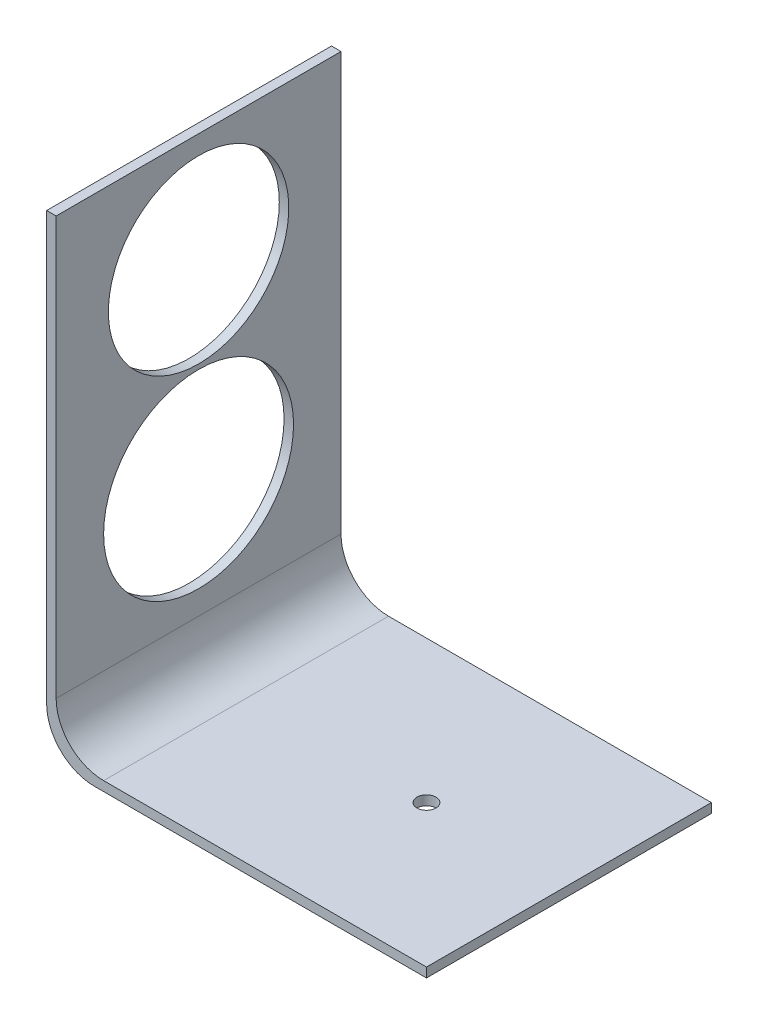
ISO-10303-21;
HEADER;
FILE_DESCRIPTION(('STEP AP214'),'2;1');
FILE_NAME('part.step','',(''),(''),'','','');
FILE_SCHEMA(('AUTOMOTIVE_DESIGN { 1 0 10303 214 1 1 1 1 }'));
ENDSEC;
DATA;
#1=APPLICATION_CONTEXT('core data for automotive mechanical design processes');
#2=APPLICATION_PROTOCOL_DEFINITION('international standard','automotive_design',2000,#1);
#3=PRODUCT_CONTEXT('',#1,'mechanical');
#4=PRODUCT('Part','Part','',(#3));
#5=PRODUCT_RELATED_PRODUCT_CATEGORY('part','',(#4));
#6=PRODUCT_DEFINITION_FORMATION('','',#4);
#7=PRODUCT_DEFINITION_CONTEXT('part definition',#1,'design');
#8=PRODUCT_DEFINITION('design','',#6,#7);
#9=PRODUCT_DEFINITION_SHAPE('','',#8);
#10=(LENGTH_UNIT() NAMED_UNIT(*) SI_UNIT(.MILLI.,.METRE.));
#11=(NAMED_UNIT(*) PLANE_ANGLE_UNIT() SI_UNIT($,.RADIAN.));
#12=(NAMED_UNIT(*) SI_UNIT($,.STERADIAN.) SOLID_ANGLE_UNIT());
#13=UNCERTAINTY_MEASURE_WITH_UNIT(LENGTH_MEASURE(1.E-05),#10,'distance_accuracy_value','');
#14=(GEOMETRIC_REPRESENTATION_CONTEXT(3) GLOBAL_UNCERTAINTY_ASSIGNED_CONTEXT((#13)) GLOBAL_UNIT_ASSIGNED_CONTEXT((#10,
#11,#12)) REPRESENTATION_CONTEXT('',''));
#15=CARTESIAN_POINT('',(0.,0.,0.));
#16=DIRECTION('',(0.,0.,1.));
#17=DIRECTION('',(1.,0.,0.));
#18=AXIS2_PLACEMENT_3D('',#15,#16,#17);
#19=CARTESIAN_POINT('',(-24.8275862068966,-14.7413793103448,60.));
#20=DIRECTION('',(1.,0.,0.));
#21=DIRECTION('',(0.,0.,-1.));
#22=AXIS2_PLACEMENT_3D('',#19,#20,#21);
#23=PLANE('',#22);
#24=CARTESIAN_POINT('',(-24.8275862068966,52.2586206896552,30.));
#25=DIRECTION('',(1.,0.,0.));
#26=DIRECTION('',(0.,0.,-1.));
#27=AXIS2_PLACEMENT_3D('',#24,#25,#26);
#28=CIRCLE('',#27,19.);
#29=CARTESIAN_POINT('',(-24.8275862068966,52.2586206896552,11.));
#30=VERTEX_POINT('',#29);
#31=EDGE_CURVE('E182',#30,#30,#28,.T.);
#32=ORIENTED_EDGE('',*,*,#31,.T.);
#33=EDGE_LOOP('',(#32));
#34=FACE_BOUND('',#33,.T.);
#35=CARTESIAN_POINT('',(-24.8275862068966,12.2586206896553,30.));
#36=DIRECTION('',(1.,0.,0.));
#37=DIRECTION('',(0.,0.,-1.));
#38=AXIS2_PLACEMENT_3D('',#35,#36,#37);
#39=CIRCLE('',#38,20.);
#40=CARTESIAN_POINT('',(-24.8275862068966,12.2586206896553,9.99999999999999));
#41=VERTEX_POINT('',#40);
#42=EDGE_CURVE('E133',#41,#41,#39,.T.);
#43=ORIENTED_EDGE('',*,*,#42,.T.);
#44=EDGE_LOOP('',(#43));
#45=FACE_BOUND('',#44,.T.);
#46=DIRECTION('',(0.,-1.,0.));
#47=VECTOR('',#46,1.);
#48=CARTESIAN_POINT('',(-24.8275862068966,-14.7413793103448,0.));
#49=LINE('',#48,#47);
#50=CARTESIAN_POINT('',(-24.8275862068966,75.2586206896552,0.));
#51=VERTEX_POINT('',#50);
#52=CARTESIAN_POINT('',(-24.8275862068966,-14.7413793103448,0.));
#53=VERTEX_POINT('',#52);
#54=EDGE_CURVE('E129',#51,#53,#49,.T.);
#55=ORIENTED_EDGE('',*,*,#54,.T.);
#56=DIRECTION('',(0.,0.,-1.));
#57=VECTOR('',#56,1.);
#58=CARTESIAN_POINT('',(-24.8275862068966,-14.7413793103448,60.));
#59=LINE('',#58,#57);
#60=CARTESIAN_POINT('',(-24.8275862068966,-14.7413793103448,60.));
#61=VERTEX_POINT('',#60);
#62=EDGE_CURVE('E11',#61,#53,#59,.T.);
#63=ORIENTED_EDGE('',*,*,#62,.F.);
#64=DIRECTION('',(0.,-1.,0.));
#65=VECTOR('',#64,1.);
#66=CARTESIAN_POINT('',(-24.8275862068966,-14.7413793103448,60.));
#67=LINE('',#66,#65);
#68=CARTESIAN_POINT('',(-24.8275862068966,75.2586206896552,60.));
#69=VERTEX_POINT('',#68);
#70=EDGE_CURVE('E144',#69,#61,#67,.T.);
#71=ORIENTED_EDGE('',*,*,#70,.F.);
#72=DIRECTION('',(0.,0.,-1.));
#73=VECTOR('',#72,1.);
#74=CARTESIAN_POINT('',(-24.8275862068966,75.2586206896552,60.));
#75=LINE('',#74,#73);
#76=EDGE_CURVE('E125',#69,#51,#75,.T.);
#77=ORIENTED_EDGE('',*,*,#76,.T.);
#78=EDGE_LOOP('',(#55,#63,#71,#77));
#79=FACE_BOUND('',#78,.T.);
#80=ADVANCED_FACE('F33',(#34,#45,#79),#23,.F.);
#81=CARTESIAN_POINT('',(-14.8275862068966,-14.7413793103448,60.));
#82=DIRECTION('',(0.,0.,-1.));
#83=DIRECTION('',(-1.,0.,0.));
#84=AXIS2_PLACEMENT_3D('',#81,#82,#83);
#85=CYLINDRICAL_SURFACE('',#84,10.);
#86=CARTESIAN_POINT('',(-14.8275862068966,-14.7413793103448,0.));
#87=DIRECTION('',(0.,0.,1.));
#88=DIRECTION('',(-1.,0.,0.));
#89=AXIS2_PLACEMENT_3D('',#86,#87,#88);
#90=CIRCLE('',#89,10.);
#91=CARTESIAN_POINT('',(-14.8275862068965,-24.7413793103448,0.));
#92=VERTEX_POINT('',#91);
#93=EDGE_CURVE('E132',#53,#92,#90,.T.);
#94=ORIENTED_EDGE('',*,*,#93,.T.);
#95=DIRECTION('',(0.,0.,-1.));
#96=VECTOR('',#95,1.);
#97=CARTESIAN_POINT('',(-14.8275862068965,-24.7413793103448,60.));
#98=LINE('',#97,#96);
#99=CARTESIAN_POINT('',(-14.8275862068965,-24.7413793103448,60.));
#100=VERTEX_POINT('',#99);
#101=EDGE_CURVE('E41',#100,#92,#98,.T.);
#102=ORIENTED_EDGE('',*,*,#101,.F.);
#103=CARTESIAN_POINT('',(-14.8275862068966,-14.7413793103448,60.));
#104=DIRECTION('',(0.,0.,1.));
#105=DIRECTION('',(-1.,0.,0.));
#106=AXIS2_PLACEMENT_3D('',#103,#104,#105);
#107=CIRCLE('',#106,10.);
#108=EDGE_CURVE('E92',#61,#100,#107,.T.);
#109=ORIENTED_EDGE('',*,*,#108,.F.);
#110=ORIENTED_EDGE('',*,*,#62,.T.);
#111=EDGE_LOOP('',(#94,#102,#109,#110));
#112=FACE_BOUND('',#111,.T.);
#113=ADVANCED_FACE('F207',(#112),#85,.T.);
#114=CARTESIAN_POINT('',(55.1724137931034,-24.7413793103448,60.));
#115=DIRECTION('',(0.,1.,0.));
#116=DIRECTION('',(-1.,0.,0.));
#117=AXIS2_PLACEMENT_3D('',#114,#115,#116);
#118=PLANE('',#117);
#119=CARTESIAN_POINT('',(25.1724137931034,-24.7413793103448,30.));
#120=DIRECTION('',(0.,1.,0.));
#121=DIRECTION('',(-1.,0.,0.));
#122=AXIS2_PLACEMENT_3D('',#119,#120,#121);
#123=CIRCLE('',#122,2.);
#124=CARTESIAN_POINT('',(23.1724137931034,-24.7413793103448,30.));
#125=VERTEX_POINT('',#124);
#126=EDGE_CURVE('E188',#125,#125,#123,.T.);
#127=ORIENTED_EDGE('',*,*,#126,.T.);
#128=EDGE_LOOP('',(#127));
#129=FACE_BOUND('',#128,.T.);
#130=DIRECTION('',(1.,0.,0.));
#131=VECTOR('',#130,1.);
#132=CARTESIAN_POINT('',(55.1724137931034,-24.7413793103448,0.));
#133=LINE('',#132,#131);
#134=CARTESIAN_POINT('',(55.1724137931034,-24.7413793103448,0.));
#135=VERTEX_POINT('',#134);
#136=EDGE_CURVE('E135',#92,#135,#133,.T.);
#137=ORIENTED_EDGE('',*,*,#136,.T.);
#138=DIRECTION('',(0.,0.,-1.));
#139=VECTOR('',#138,1.);
#140=CARTESIAN_POINT('',(55.1724137931034,-24.7413793103448,60.));
#141=LINE('',#140,#139);
#142=CARTESIAN_POINT('',(55.1724137931034,-24.7413793103448,60.));
#143=VERTEX_POINT('',#142);
#144=EDGE_CURVE('E151',#143,#135,#141,.T.);
#145=ORIENTED_EDGE('',*,*,#144,.F.);
#146=DIRECTION('',(1.,0.,0.));
#147=VECTOR('',#146,1.);
#148=CARTESIAN_POINT('',(55.1724137931034,-24.7413793103448,60.));
#149=LINE('',#148,#147);
#150=EDGE_CURVE('E159',#100,#143,#149,.T.);
#151=ORIENTED_EDGE('',*,*,#150,.F.);
#152=ORIENTED_EDGE('',*,*,#101,.T.);
#153=EDGE_LOOP('',(#137,#145,#151,#152));
#154=FACE_BOUND('',#153,.T.);
#155=ADVANCED_FACE('F157',(#129,#154),#118,.F.);
#156=CARTESIAN_POINT('',(55.1724137931034,-22.7413793103448,60.));
#157=DIRECTION('',(-1.,0.,0.));
#158=DIRECTION('',(0.,0.,1.));
#159=AXIS2_PLACEMENT_3D('',#156,#157,#158);
#160=PLANE('',#159);
#161=DIRECTION('',(0.,1.,0.));
#162=VECTOR('',#161,1.);
#163=CARTESIAN_POINT('',(55.1724137931034,-22.7413793103448,0.));
#164=LINE('',#163,#162);
#165=CARTESIAN_POINT('',(55.1724137931034,-22.7413793103448,0.));
#166=VERTEX_POINT('',#165);
#167=EDGE_CURVE('E137',#135,#166,#164,.T.);
#168=ORIENTED_EDGE('',*,*,#167,.T.);
#169=DIRECTION('',(0.,0.,-1.));
#170=VECTOR('',#169,1.);
#171=CARTESIAN_POINT('',(55.1724137931034,-22.7413793103448,60.));
#172=LINE('',#171,#170);
#173=CARTESIAN_POINT('',(55.1724137931034,-22.7413793103448,60.));
#174=VERTEX_POINT('',#173);
#175=EDGE_CURVE('E148',#174,#166,#172,.T.);
#176=ORIENTED_EDGE('',*,*,#175,.F.);
#177=DIRECTION('',(0.,1.,0.));
#178=VECTOR('',#177,1.);
#179=CARTESIAN_POINT('',(55.1724137931034,-22.7413793103448,60.));
#180=LINE('',#179,#178);
#181=EDGE_CURVE('E171',#143,#174,#180,.T.);
#182=ORIENTED_EDGE('',*,*,#181,.F.);
#183=ORIENTED_EDGE('',*,*,#144,.T.);
#184=EDGE_LOOP('',(#168,#176,#182,#183));
#185=FACE_BOUND('',#184,.T.);
#186=ADVANCED_FACE('F167',(#185),#160,.F.);
#187=CARTESIAN_POINT('',(-12.8275862068965,-22.7413793103448,60.));
#188=DIRECTION('',(0.,-1.,0.));
#189=DIRECTION('',(0.,0.,-1.));
#190=AXIS2_PLACEMENT_3D('',#187,#188,#189);
#191=PLANE('',#190);
#192=CARTESIAN_POINT('',(25.1724137931034,-22.7413793103448,30.));
#193=DIRECTION('',(0.,1.,0.));
#194=DIRECTION('',(0.,0.,1.));
#195=AXIS2_PLACEMENT_3D('',#192,#193,#194);
#196=CIRCLE('',#195,2.);
#197=CARTESIAN_POINT('',(25.1724137931034,-22.7413793103448,32.));
#198=VERTEX_POINT('',#197);
#199=EDGE_CURVE('E191',#198,#198,#196,.T.);
#200=ORIENTED_EDGE('',*,*,#199,.F.);
#201=EDGE_LOOP('',(#200));
#202=FACE_BOUND('',#201,.T.);
#203=DIRECTION('',(-1.,0.,0.));
#204=VECTOR('',#203,1.);
#205=CARTESIAN_POINT('',(-12.8275862068965,-22.7413793103448,0.));
#206=LINE('',#205,#204);
#207=CARTESIAN_POINT('',(-12.8275862068965,-22.7413793103448,0.));
#208=VERTEX_POINT('',#207);
#209=EDGE_CURVE('E139',#166,#208,#206,.T.);
#210=ORIENTED_EDGE('',*,*,#209,.T.);
#211=DIRECTION('',(0.,0.,-1.));
#212=VECTOR('',#211,1.);
#213=CARTESIAN_POINT('',(-12.8275862068965,-22.7413793103448,60.));
#214=LINE('',#213,#212);
#215=CARTESIAN_POINT('',(-12.8275862068965,-22.7413793103448,60.));
#216=VERTEX_POINT('',#215);
#217=EDGE_CURVE('E120',#216,#208,#214,.T.);
#218=ORIENTED_EDGE('',*,*,#217,.F.);
#219=DIRECTION('',(-1.,0.,0.));
#220=VECTOR('',#219,1.);
#221=CARTESIAN_POINT('',(-12.8275862068965,-22.7413793103448,60.));
#222=LINE('',#221,#220);
#223=EDGE_CURVE('E111',#174,#216,#222,.T.);
#224=ORIENTED_EDGE('',*,*,#223,.F.);
#225=ORIENTED_EDGE('',*,*,#175,.T.);
#226=EDGE_LOOP('',(#210,#218,#224,#225));
#227=FACE_BOUND('',#226,.T.);
#228=ADVANCED_FACE('F170',(#202,#227),#191,.F.);
#229=CARTESIAN_POINT('',(-12.8275862068965,-12.7413793103448,60.));
#230=DIRECTION('',(0.,0.,-1.));
#231=DIRECTION('',(-1.,0.,0.));
#232=AXIS2_PLACEMENT_3D('',#229,#230,#231);
#233=CYLINDRICAL_SURFACE('',#232,10.);
#234=CARTESIAN_POINT('',(-12.8275862068965,-12.7413793103448,0.));
#235=DIRECTION('',(0.,0.,-1.));
#236=DIRECTION('',(-1.,0.,0.));
#237=AXIS2_PLACEMENT_3D('',#234,#235,#236);
#238=CIRCLE('',#237,10.);
#239=CARTESIAN_POINT('',(-22.8275862068965,-12.7413793103448,0.));
#240=VERTEX_POINT('',#239);
#241=EDGE_CURVE('E119',#208,#240,#238,.T.);
#242=ORIENTED_EDGE('',*,*,#241,.T.);
#243=DIRECTION('',(0.,0.,-1.));
#244=VECTOR('',#243,1.);
#245=CARTESIAN_POINT('',(-22.8275862068965,-12.7413793103448,60.));
#246=LINE('',#245,#244);
#247=CARTESIAN_POINT('',(-22.8275862068965,-12.7413793103448,60.));
#248=VERTEX_POINT('',#247);
#249=EDGE_CURVE('E116',#248,#240,#246,.T.);
#250=ORIENTED_EDGE('',*,*,#249,.F.);
#251=CARTESIAN_POINT('',(-12.8275862068965,-12.7413793103448,60.));
#252=DIRECTION('',(0.,0.,-1.));
#253=DIRECTION('',(-1.,0.,0.));
#254=AXIS2_PLACEMENT_3D('',#251,#252,#253);
#255=CIRCLE('',#254,10.);
#256=EDGE_CURVE('E105',#216,#248,#255,.T.);
#257=ORIENTED_EDGE('',*,*,#256,.F.);
#258=ORIENTED_EDGE('',*,*,#217,.T.);
#259=EDGE_LOOP('',(#242,#250,#257,#258));
#260=FACE_BOUND('',#259,.T.);
#261=ADVANCED_FACE('F117',(#260),#233,.F.);
#262=CARTESIAN_POINT('',(-22.8275862068966,75.2586206896552,60.));
#263=DIRECTION('',(-1.,0.,0.));
#264=DIRECTION('',(0.,-1.,0.));
#265=AXIS2_PLACEMENT_3D('',#262,#263,#264);
#266=PLANE('',#265);
#267=CARTESIAN_POINT('',(-22.8275862068966,52.2586206896552,30.));
#268=DIRECTION('',(1.,0.,0.));
#269=DIRECTION('',(0.,1.,0.));
#270=AXIS2_PLACEMENT_3D('',#267,#268,#269);
#271=CIRCLE('',#270,19.);
#272=CARTESIAN_POINT('',(-22.8275862068966,71.2586206896552,30.));
#273=VERTEX_POINT('',#272);
#274=EDGE_CURVE('E185',#273,#273,#271,.T.);
#275=ORIENTED_EDGE('',*,*,#274,.F.);
#276=EDGE_LOOP('',(#275));
#277=FACE_BOUND('',#276,.T.);
#278=CARTESIAN_POINT('',(-22.8275862068965,12.2586206896553,30.));
#279=DIRECTION('',(1.,0.,0.));
#280=DIRECTION('',(0.,1.,0.));
#281=AXIS2_PLACEMENT_3D('',#278,#279,#280);
#282=CIRCLE('',#281,20.);
#283=CARTESIAN_POINT('',(-22.8275862068966,32.2586206896553,30.));
#284=VERTEX_POINT('',#283);
#285=EDGE_CURVE('E179',#284,#284,#282,.T.);
#286=ORIENTED_EDGE('',*,*,#285,.F.);
#287=EDGE_LOOP('',(#286));
#288=FACE_BOUND('',#287,.T.);
#289=DIRECTION('',(0.,1.,0.));
#290=VECTOR('',#289,1.);
#291=CARTESIAN_POINT('',(-22.8275862068966,75.2586206896552,0.));
#292=LINE('',#291,#290);
#293=CARTESIAN_POINT('',(-22.8275862068966,75.2586206896552,0.));
#294=VERTEX_POINT('',#293);
#295=EDGE_CURVE('E78',#240,#294,#292,.T.);
#296=ORIENTED_EDGE('',*,*,#295,.T.);
#297=DIRECTION('',(0.,0.,-1.));
#298=VECTOR('',#297,1.);
#299=CARTESIAN_POINT('',(-22.8275862068966,75.2586206896552,60.));
#300=LINE('',#299,#298);
#301=CARTESIAN_POINT('',(-22.8275862068966,75.2586206896552,60.));
#302=VERTEX_POINT('',#301);
#303=EDGE_CURVE('E121',#302,#294,#300,.T.);
#304=ORIENTED_EDGE('',*,*,#303,.F.);
#305=DIRECTION('',(0.,1.,0.));
#306=VECTOR('',#305,1.);
#307=CARTESIAN_POINT('',(-22.8275862068966,75.2586206896552,60.));
#308=LINE('',#307,#306);
#309=EDGE_CURVE('E109',#248,#302,#308,.T.);
#310=ORIENTED_EDGE('',*,*,#309,.F.);
#311=ORIENTED_EDGE('',*,*,#249,.T.);
#312=EDGE_LOOP('',(#296,#304,#310,#311));
#313=FACE_BOUND('',#312,.T.);
#314=ADVANCED_FACE('F123',(#277,#288,#313),#266,.F.);
#315=CARTESIAN_POINT('',(-24.8275862068966,75.2586206896552,60.));
#316=DIRECTION('',(0.,-1.,0.));
#317=DIRECTION('',(0.,0.,-1.));
#318=AXIS2_PLACEMENT_3D('',#315,#316,#317);
#319=PLANE('',#318);
#320=DIRECTION('',(-1.,0.,0.));
#321=VECTOR('',#320,1.);
#322=CARTESIAN_POINT('',(-24.8275862068966,75.2586206896552,0.));
#323=LINE('',#322,#321);
#324=EDGE_CURVE('E84',#294,#51,#323,.T.);
#325=ORIENTED_EDGE('',*,*,#324,.T.);
#326=ORIENTED_EDGE('',*,*,#76,.F.);
#327=DIRECTION('',(-1.,0.,0.));
#328=VECTOR('',#327,1.);
#329=CARTESIAN_POINT('',(-24.8275862068966,75.2586206896552,60.));
#330=LINE('',#329,#328);
#331=EDGE_CURVE('E49',#302,#69,#330,.T.);
#332=ORIENTED_EDGE('',*,*,#331,.F.);
#333=ORIENTED_EDGE('',*,*,#303,.T.);
#334=EDGE_LOOP('',(#325,#326,#332,#333));
#335=FACE_BOUND('',#334,.T.);
#336=ADVANCED_FACE('F218',(#335),#319,.F.);
#337=CARTESIAN_POINT('',(-12.8275862068965,-12.7413793103448,60.));
#338=DIRECTION('',(0.,0.,-1.));
#339=DIRECTION('',(-1.,0.,0.));
#340=AXIS2_PLACEMENT_3D('',#337,#338,#339);
#341=PLANE('',#340);
#342=ORIENTED_EDGE('',*,*,#70,.T.);
#343=ORIENTED_EDGE('',*,*,#108,.T.);
#344=ORIENTED_EDGE('',*,*,#150,.T.);
#345=ORIENTED_EDGE('',*,*,#181,.T.);
#346=ORIENTED_EDGE('',*,*,#223,.T.);
#347=ORIENTED_EDGE('',*,*,#256,.T.);
#348=ORIENTED_EDGE('',*,*,#309,.T.);
#349=ORIENTED_EDGE('',*,*,#331,.T.);
#350=EDGE_LOOP('',(#342,#343,#344,#345,#346,#347,#348,#349));
#351=FACE_BOUND('',#350,.T.);
#352=ADVANCED_FACE('F107',(#351),#341,.F.);
#353=CARTESIAN_POINT('',(-12.8275862068965,-12.7413793103448,0.));
#354=DIRECTION('',(0.,0.,-1.));
#355=DIRECTION('',(-1.,0.,0.));
#356=AXIS2_PLACEMENT_3D('',#353,#354,#355);
#357=PLANE('',#356);
#358=ORIENTED_EDGE('',*,*,#54,.F.);
#359=ORIENTED_EDGE('',*,*,#324,.F.);
#360=ORIENTED_EDGE('',*,*,#295,.F.);
#361=ORIENTED_EDGE('',*,*,#241,.F.);
#362=ORIENTED_EDGE('',*,*,#209,.F.);
#363=ORIENTED_EDGE('',*,*,#167,.F.);
#364=ORIENTED_EDGE('',*,*,#136,.F.);
#365=ORIENTED_EDGE('',*,*,#93,.F.);
#366=EDGE_LOOP('',(#358,#359,#360,#361,#362,#363,#364,#365));
#367=FACE_BOUND('',#366,.T.);
#368=ADVANCED_FACE('F163',(#367),#357,.T.);
#369=CARTESIAN_POINT('',(-32.8275862068965,12.2586206896552,30.));
#370=DIRECTION('',(1.,0.,0.));
#371=DIRECTION('',(0.,1.,0.));
#372=AXIS2_PLACEMENT_3D('',#369,#370,#371);
#373=CYLINDRICAL_SURFACE('',#372,20.);
#374=ORIENTED_EDGE('',*,*,#285,.T.);
#375=EDGE_LOOP('',(#374));
#376=FACE_BOUND('',#375,.T.);
#377=ORIENTED_EDGE('',*,*,#42,.F.);
#378=EDGE_LOOP('',(#377));
#379=FACE_BOUND('',#378,.T.);
#380=ADVANCED_FACE('F230',(#376,#379),#373,.F.);
#381=CARTESIAN_POINT('',(-32.8275862068966,52.2586206896552,30.));
#382=DIRECTION('',(1.,0.,0.));
#383=DIRECTION('',(0.,1.,0.));
#384=AXIS2_PLACEMENT_3D('',#381,#382,#383);
#385=CYLINDRICAL_SURFACE('',#384,19.);
#386=ORIENTED_EDGE('',*,*,#274,.T.);
#387=EDGE_LOOP('',(#386));
#388=FACE_BOUND('',#387,.T.);
#389=ORIENTED_EDGE('',*,*,#31,.F.);
#390=EDGE_LOOP('',(#389));
#391=FACE_BOUND('',#390,.T.);
#392=ADVANCED_FACE('F234',(#388,#391),#385,.F.);
#393=CARTESIAN_POINT('',(25.1724137931034,-32.7413793103448,30.));
#394=DIRECTION('',(0.,1.,0.));
#395=DIRECTION('',(0.,0.,1.));
#396=AXIS2_PLACEMENT_3D('',#393,#394,#395);
#397=CYLINDRICAL_SURFACE('',#396,2.);
#398=ORIENTED_EDGE('',*,*,#199,.T.);
#399=EDGE_LOOP('',(#398));
#400=FACE_BOUND('',#399,.T.);
#401=ORIENTED_EDGE('',*,*,#126,.F.);
#402=EDGE_LOOP('',(#401));
#403=FACE_BOUND('',#402,.T.);
#404=ADVANCED_FACE('F195',(#400,#403),#397,.F.);
#405=CLOSED_SHELL('',(#80,#113,#155,#186,#228,#261,#314,#336,#352,#368,#380,#392,#404));
#406=MANIFOLD_SOLID_BREP('B2',#405);
#407=ADVANCED_BREP_SHAPE_REPRESENTATION('',(#18,#406),#14);
#408=SHAPE_DEFINITION_REPRESENTATION(#9,#407);
ENDSEC;
END-ISO-10303-21;
